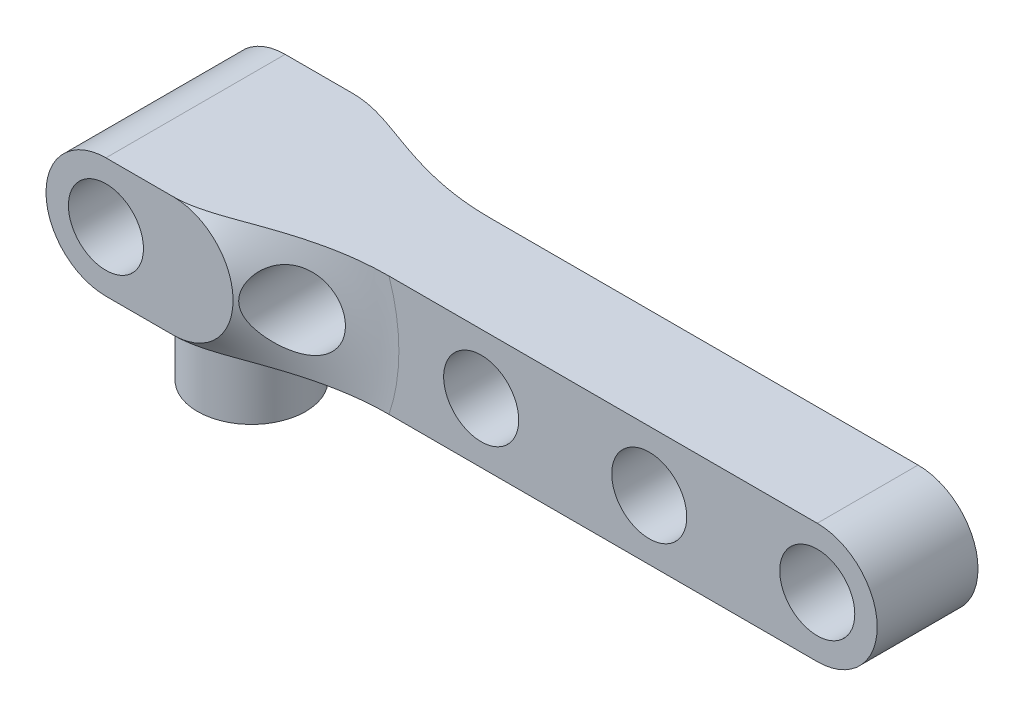
ISO-10303-21;
HEADER;
FILE_DESCRIPTION(('STEP AP214'),'2;1');
FILE_NAME('part.step','',(''),(''),'','','');
FILE_SCHEMA(('AUTOMOTIVE_DESIGN { 1 0 10303 214 1 1 1 1 }'));
ENDSEC;
DATA;
#1=APPLICATION_CONTEXT('core data for automotive mechanical design processes');
#2=APPLICATION_PROTOCOL_DEFINITION('international standard','automotive_design',2000,#1);
#3=PRODUCT_CONTEXT('',#1,'mechanical');
#4=PRODUCT('Part','Part','',(#3));
#5=PRODUCT_RELATED_PRODUCT_CATEGORY('part','',(#4));
#6=PRODUCT_DEFINITION_FORMATION('','',#4);
#7=PRODUCT_DEFINITION_CONTEXT('part definition',#1,'design');
#8=PRODUCT_DEFINITION('design','',#6,#7);
#9=PRODUCT_DEFINITION_SHAPE('','',#8);
#10=(LENGTH_UNIT() NAMED_UNIT(*) SI_UNIT(.MILLI.,.METRE.));
#11=(NAMED_UNIT(*) PLANE_ANGLE_UNIT() SI_UNIT($,.RADIAN.));
#12=(NAMED_UNIT(*) SI_UNIT($,.STERADIAN.) SOLID_ANGLE_UNIT());
#13=UNCERTAINTY_MEASURE_WITH_UNIT(LENGTH_MEASURE(1.E-05),#10,'distance_accuracy_value','');
#14=(GEOMETRIC_REPRESENTATION_CONTEXT(3) GLOBAL_UNCERTAINTY_ASSIGNED_CONTEXT((#13)) GLOBAL_UNIT_ASSIGNED_CONTEXT((#10,
#11,#12)) REPRESENTATION_CONTEXT('',''));
#15=CARTESIAN_POINT('',(0.,0.,0.));
#16=DIRECTION('',(0.,0.,1.));
#17=DIRECTION('',(1.,0.,0.));
#18=AXIS2_PLACEMENT_3D('',#15,#16,#17);
#19=CARTESIAN_POINT('',(-15.,0.,2.25));
#20=DIRECTION('',(0.,0.,1.));
#21=DIRECTION('',(1.,0.,0.));
#22=AXIS2_PLACEMENT_3D('',#19,#20,#21);
#23=PLANE('',#22);
#24=CARTESIAN_POINT('',(15.,0.,2.25));
#25=DIRECTION('',(0.,0.,1.));
#26=DIRECTION('',(1.,0.,0.));
#27=AXIS2_PLACEMENT_3D('',#24,#25,#26);
#28=CIRCLE('',#27,1.675);
#29=CARTESIAN_POINT('',(16.675,0.,2.25));
#30=VERTEX_POINT('',#29);
#31=EDGE_CURVE('E306',#30,#30,#28,.T.);
#32=ORIENTED_EDGE('',*,*,#31,.F.);
#33=EDGE_LOOP('',(#32));
#34=FACE_BOUND('',#33,.T.);
#35=CARTESIAN_POINT('',(0.,0.,2.25));
#36=DIRECTION('',(0.,0.,1.));
#37=DIRECTION('',(1.,0.,0.));
#38=AXIS2_PLACEMENT_3D('',#35,#36,#37);
#39=CIRCLE('',#38,1.675);
#40=CARTESIAN_POINT('',(1.675,0.,2.25));
#41=VERTEX_POINT('',#40);
#42=EDGE_CURVE('E226',#41,#41,#39,.T.);
#43=ORIENTED_EDGE('',*,*,#42,.F.);
#44=EDGE_LOOP('',(#43));
#45=FACE_BOUND('',#44,.T.);
#46=CARTESIAN_POINT('',(7.5,0.,2.25));
#47=DIRECTION('',(0.,0.,1.));
#48=DIRECTION('',(1.,0.,0.));
#49=AXIS2_PLACEMENT_3D('',#46,#47,#48);
#50=CIRCLE('',#49,1.675);
#51=CARTESIAN_POINT('',(9.175,0.,2.25));
#52=VERTEX_POINT('',#51);
#53=EDGE_CURVE('E237',#52,#52,#50,.T.);
#54=ORIENTED_EDGE('',*,*,#53,.F.);
#55=EDGE_LOOP('',(#54));
#56=FACE_BOUND('',#55,.T.);
#57=DIRECTION('',(-1.,0.,0.));
#58=VECTOR('',#57,1.);
#59=CARTESIAN_POINT('',(-15.,2.675,2.25));
#60=LINE('',#59,#58);
#61=CARTESIAN_POINT('',(15.,2.675,2.25));
#62=VERTEX_POINT('',#61);
#63=CARTESIAN_POINT('',(-4.1150712789621,2.675,2.25));
#64=VERTEX_POINT('',#63);
#65=EDGE_CURVE('E250',#62,#64,#60,.T.);
#66=ORIENTED_EDGE('',*,*,#65,.T.);
#67=CARTESIAN_POINT('',(-12.,0.,2.25));
#68=DIRECTION('',(0.,0.,1.));
#69=DIRECTION('',(1.,0.,0.));
#70=AXIS2_PLACEMENT_3D('',#67,#68,#69);
#71=CIRCLE('',#70,8.32632727772866);
#72=CARTESIAN_POINT('',(-4.1150712789621,-2.675,2.25));
#73=VERTEX_POINT('',#72);
#74=EDGE_CURVE('E127',#64,#73,#71,.F.);
#75=ORIENTED_EDGE('',*,*,#74,.T.);
#76=DIRECTION('',(1.,0.,0.));
#77=VECTOR('',#76,1.);
#78=CARTESIAN_POINT('',(-15.,-2.675,2.25));
#79=LINE('',#78,#77);
#80=CARTESIAN_POINT('',(15.,-2.675,2.25));
#81=VERTEX_POINT('',#80);
#82=EDGE_CURVE('E243',#73,#81,#79,.T.);
#83=ORIENTED_EDGE('',*,*,#82,.T.);
#84=CARTESIAN_POINT('',(15.,0.,2.25));
#85=DIRECTION('',(0.,0.,1.));
#86=DIRECTION('',(1.,0.,0.));
#87=AXIS2_PLACEMENT_3D('',#84,#85,#86);
#88=CIRCLE('',#87,2.675);
#89=EDGE_CURVE('E246',#81,#62,#88,.T.);
#90=ORIENTED_EDGE('',*,*,#89,.T.);
#91=EDGE_LOOP('',(#66,#75,#83,#90));
#92=FACE_BOUND('',#91,.T.);
#93=ADVANCED_FACE('F39',(#34,#45,#56,#92),#23,.T.);
#94=CARTESIAN_POINT('',(-15.,0.,-2.25));
#95=DIRECTION('',(0.,0.,1.));
#96=DIRECTION('',(1.,0.,0.));
#97=AXIS2_PLACEMENT_3D('',#94,#95,#96);
#98=PLANE('',#97);
#99=CARTESIAN_POINT('',(15.,0.,-2.25));
#100=DIRECTION('',(0.,0.,1.));
#101=DIRECTION('',(1.,0.,0.));
#102=AXIS2_PLACEMENT_3D('',#99,#100,#101);
#103=CIRCLE('',#102,1.675);
#104=CARTESIAN_POINT('',(16.675,0.,-2.25));
#105=VERTEX_POINT('',#104);
#106=EDGE_CURVE('E310',#105,#105,#103,.T.);
#107=ORIENTED_EDGE('',*,*,#106,.T.);
#108=EDGE_LOOP('',(#107));
#109=FACE_BOUND('',#108,.T.);
#110=CARTESIAN_POINT('',(7.5,0.,-2.25));
#111=DIRECTION('',(0.,0.,1.));
#112=DIRECTION('',(1.,0.,0.));
#113=AXIS2_PLACEMENT_3D('',#110,#111,#112);
#114=CIRCLE('',#113,1.675);
#115=CARTESIAN_POINT('',(9.175,0.,-2.25));
#116=VERTEX_POINT('',#115);
#117=EDGE_CURVE('E240',#116,#116,#114,.T.);
#118=ORIENTED_EDGE('',*,*,#117,.T.);
#119=EDGE_LOOP('',(#118));
#120=FACE_BOUND('',#119,.T.);
#121=CARTESIAN_POINT('',(0.,0.,-2.25));
#122=DIRECTION('',(0.,0.,1.));
#123=DIRECTION('',(1.,0.,0.));
#124=AXIS2_PLACEMENT_3D('',#121,#122,#123);
#125=CIRCLE('',#124,1.675);
#126=CARTESIAN_POINT('',(1.675,0.,-2.25));
#127=VERTEX_POINT('',#126);
#128=EDGE_CURVE('E231',#127,#127,#125,.T.);
#129=ORIENTED_EDGE('',*,*,#128,.T.);
#130=EDGE_LOOP('',(#129));
#131=FACE_BOUND('',#130,.T.);
#132=DIRECTION('',(1.,0.,0.));
#133=VECTOR('',#132,1.);
#134=CARTESIAN_POINT('',(-15.,-2.675,-2.25));
#135=LINE('',#134,#133);
#136=CARTESIAN_POINT('',(-4.1150712789621,-2.675,-2.25));
#137=VERTEX_POINT('',#136);
#138=CARTESIAN_POINT('',(15.,-2.675,-2.25));
#139=VERTEX_POINT('',#138);
#140=EDGE_CURVE('E219',#137,#139,#135,.T.);
#141=ORIENTED_EDGE('',*,*,#140,.F.);
#142=CARTESIAN_POINT('',(-12.,0.,-2.25));
#143=DIRECTION('',(0.,0.,1.));
#144=DIRECTION('',(1.,0.,0.));
#145=AXIS2_PLACEMENT_3D('',#142,#143,#144);
#146=CIRCLE('',#145,8.32632727772866);
#147=CARTESIAN_POINT('',(-4.1150712789621,2.675,-2.25));
#148=VERTEX_POINT('',#147);
#149=EDGE_CURVE('E270',#137,#148,#146,.T.);
#150=ORIENTED_EDGE('',*,*,#149,.T.);
#151=DIRECTION('',(-1.,0.,0.));
#152=VECTOR('',#151,1.);
#153=CARTESIAN_POINT('',(-15.,2.675,-2.25));
#154=LINE('',#153,#152);
#155=CARTESIAN_POINT('',(15.,2.675,-2.25));
#156=VERTEX_POINT('',#155);
#157=EDGE_CURVE('E247',#156,#148,#154,.T.);
#158=ORIENTED_EDGE('',*,*,#157,.F.);
#159=CARTESIAN_POINT('',(15.,0.,-2.25));
#160=DIRECTION('',(0.,0.,1.));
#161=DIRECTION('',(1.,0.,0.));
#162=AXIS2_PLACEMENT_3D('',#159,#160,#161);
#163=CIRCLE('',#162,2.675);
#164=EDGE_CURVE('E223',#139,#156,#163,.T.);
#165=ORIENTED_EDGE('',*,*,#164,.F.);
#166=EDGE_LOOP('',(#141,#150,#158,#165));
#167=FACE_BOUND('',#166,.T.);
#168=ADVANCED_FACE('F156',(#109,#120,#131,#167),#98,.F.);
#169=CARTESIAN_POINT('',(-15.,0.,2.25));
#170=DIRECTION('',(0.,0.,-1.));
#171=DIRECTION('',(-1.,0.,0.));
#172=AXIS2_PLACEMENT_3D('',#169,#170,#171);
#173=CYLINDRICAL_SURFACE('',#172,2.675);
#174=DIRECTION('',(0.,0.,-1.));
#175=VECTOR('',#174,1.);
#176=CARTESIAN_POINT('',(-15.,2.675,2.25));
#177=LINE('',#176,#175);
#178=CARTESIAN_POINT('',(-15.,2.675,4.));
#179=VERTEX_POINT('',#178);
#180=CARTESIAN_POINT('',(-15.,2.675,-4.));
#181=VERTEX_POINT('',#180);
#182=EDGE_CURVE('E110',#179,#181,#177,.T.);
#183=ORIENTED_EDGE('',*,*,#182,.T.);
#184=CARTESIAN_POINT('',(-15.,0.,-4.));
#185=DIRECTION('',(0.,0.,1.));
#186=DIRECTION('',(1.,0.,0.));
#187=AXIS2_PLACEMENT_3D('',#184,#185,#186);
#188=CIRCLE('',#187,2.675);
#189=CARTESIAN_POINT('',(-15.,-2.675,-4.));
#190=VERTEX_POINT('',#189);
#191=EDGE_CURVE('E294',#181,#190,#188,.T.);
#192=ORIENTED_EDGE('',*,*,#191,.T.);
#193=DIRECTION('',(0.,0.,-1.));
#194=VECTOR('',#193,1.);
#195=CARTESIAN_POINT('',(-15.,-2.675,2.25));
#196=LINE('',#195,#194);
#197=CARTESIAN_POINT('',(-15.,-2.675,4.));
#198=VERTEX_POINT('',#197);
#199=EDGE_CURVE('E267',#198,#190,#196,.T.);
#200=ORIENTED_EDGE('',*,*,#199,.F.);
#201=CARTESIAN_POINT('',(-15.,0.,4.));
#202=DIRECTION('',(0.,0.,1.));
#203=DIRECTION('',(1.,0.,0.));
#204=AXIS2_PLACEMENT_3D('',#201,#202,#203);
#205=CIRCLE('',#204,2.675);
#206=EDGE_CURVE('E115',#179,#198,#205,.T.);
#207=ORIENTED_EDGE('',*,*,#206,.F.);
#208=EDGE_LOOP('',(#183,#192,#200,#207));
#209=FACE_BOUND('',#208,.T.);
#210=ADVANCED_FACE('F176',(#209),#173,.T.);
#211=CARTESIAN_POINT('',(-15.,-2.675,2.25));
#212=DIRECTION('',(0.,1.,0.));
#213=DIRECTION('',(0.,0.,1.));
#214=AXIS2_PLACEMENT_3D('',#211,#212,#213);
#215=PLANE('',#214);
#216=CARTESIAN_POINT('',(-12.5,-2.675,0.));
#217=DIRECTION('',(0.,1.,0.));
#218=DIRECTION('',(0.,0.,1.));
#219=AXIS2_PLACEMENT_3D('',#216,#217,#218);
#220=CIRCLE('',#219,2.4146);
#221=CARTESIAN_POINT('',(-12.5,-2.675,2.4146));
#222=VERTEX_POINT('',#221);
#223=EDGE_CURVE('E11',#222,#222,#220,.F.);
#224=ORIENTED_EDGE('',*,*,#223,.F.);
#225=EDGE_LOOP('',(#224));
#226=FACE_BOUND('',#225,.T.);
#227=ORIENTED_EDGE('',*,*,#199,.T.);
#228=DIRECTION('',(1.,0.,0.));
#229=VECTOR('',#228,1.);
#230=CARTESIAN_POINT('',(-15.,-2.675,-4.));
#231=LINE('',#230,#229);
#232=CARTESIAN_POINT('',(-12.,-2.675,-4.));
#233=VERTEX_POINT('',#232);
#234=EDGE_CURVE('E124',#190,#233,#231,.T.);
#235=ORIENTED_EDGE('',*,*,#234,.T.);
#236=CARTESIAN_POINT('',(-12.,-2.675,-4.));
#237=CARTESIAN_POINT('',(-11.9406434531428,-2.675,-4.00001394925494));
#238=CARTESIAN_POINT('',(-11.8812914438209,-2.675,-3.99864701513769));
#239=CARTESIAN_POINT('',(-11.7627273467529,-2.675,-3.99325544617011));
#240=CARTESIAN_POINT('',(-11.7035152189759,-2.675,-3.98923169697365));
#241=CARTESIAN_POINT('',(-11.5856199549922,-2.675,-3.97865715756544));
#242=CARTESIAN_POINT('',(-11.5269356568403,-2.675,-3.97211920923495));
#243=CARTESIAN_POINT('',(-11.4098758642313,-2.675,-3.9567009178022));
#244=CARTESIAN_POINT('',(-11.3515003924756,-2.675,-3.94782040487585));
#245=CARTESIAN_POINT('',(-11.1769652204004,-2.675,-3.91800115324609));
#246=CARTESIAN_POINT('',(-11.0613418310201,-2.675,-3.89387939188613));
#247=CARTESIAN_POINT('',(-10.8890117792445,-2.675,-3.85282133412637));
#248=CARTESIAN_POINT('',(-10.8316985488899,-2.675,-3.83830659270522));
#249=CARTESIAN_POINT('',(-10.7174418021519,-2.675,-3.80790230821401));
#250=CARTESIAN_POINT('',(-10.6604982484454,-2.675,-3.79201290632709));
#251=CARTESIAN_POINT('',(-10.47056940762,-2.675,-3.73696192985336));
#252=CARTESIAN_POINT('',(-10.3383287889475,-2.675,-3.69524575065224));
#253=CARTESIAN_POINT('',(-10.075040273083,-2.675,-3.60818433291584));
#254=CARTESIAN_POINT('',(-9.94399271532131,-2.675,-3.56283809546612));
#255=CARTESIAN_POINT('',(-9.68236943639041,-2.675,-3.47047749612376));
#256=CARTESIAN_POINT('',(-9.55179419739272,-2.675,-3.42346178030654));
#257=CARTESIAN_POINT('',(-9.29070659445944,-2.675,-3.32930644579857));
#258=CARTESIAN_POINT('',(-9.1601942250026,-2.675,-3.28216684205029));
#259=CARTESIAN_POINT('',(-8.89901687197945,-2.675,-3.18896497672595));
#260=CARTESIAN_POINT('',(-8.76835246404011,-2.675,-3.142901116419));
#261=CARTESIAN_POINT('',(-8.50637508195865,-2.675,-3.05263618931163));
#262=CARTESIAN_POINT('',(-8.375062093825,-2.675,-3.00843516289506));
#263=CARTESIAN_POINT('',(-8.11165500282858,-2.675,-2.92258987508198));
#264=CARTESIAN_POINT('',(-7.97956123079111,-2.675,-2.8809446055403));
#265=CARTESIAN_POINT('',(-7.71444491048368,-2.675,-2.80072580963105));
#266=CARTESIAN_POINT('',(-7.58142235443362,-2.675,-2.76215230902823));
#267=CARTESIAN_POINT('',(-7.17947792082494,-2.675,-2.65132420221801));
#268=CARTESIAN_POINT('',(-6.90904330212611,-2.675,-2.58441691627093));
#269=CARTESIAN_POINT('',(-6.36453660798925,-2.675,-2.4674999355622));
#270=CARTESIAN_POINT('',(-6.09046470295773,-2.675,-2.41748945207112));
#271=CARTESIAN_POINT('',(-5.53380748865264,-2.675,-2.33533532525447));
#272=CARTESIAN_POINT('',(-5.25116321952226,-2.675,-2.30358175521111));
#273=CARTESIAN_POINT('',(-4.82592527140733,-2.675,-2.27157720653302));
#274=CARTESIAN_POINT('',(-4.68388692755053,-2.675,-2.26351319309605));
#275=CARTESIAN_POINT('',(-4.39959491903275,-2.675,-2.25272342355039));
#276=CARTESIAN_POINT('',(-4.25734123537064,-2.675,-2.24999816976263));
#277=CARTESIAN_POINT('',(-4.1150712789621,-2.675,-2.25));
#278=B_SPLINE_CURVE_WITH_KNOTS('',3,(#236,#237,#238,#239,#240,#241,#242,#243,#244,#245,#246,
#247,#248,#249,#250,#251,#252,#253,#254,#255,#256,#257,#258,#259,#260,#261,#262,#263,#264,#265,
#266,#267,#268,#269,#270,#271,#272,#273,#274,#275,#276,#277),.UNSPECIFIED.,.F.,.F.,(4,2,2,2,2,2,
2,2,2,2,2,2,2,2,2,2,2,2,2,2,4),(0.,0.178046532837259,0.356033743500868,0.533123663980979,
0.710226426113773,1.06426681243011,1.24162512920425,1.41896525214365,1.83484735232387,
2.25084429038093,2.66718666790429,3.08348094399999,3.49911109849096,3.91475025867891,
4.33022439760067,4.74570202098221,5.58096610718564,6.41619119853014,7.26865519978267,
7.69536861416892,8.12212217585539),.UNSPECIFIED.);
#279=EDGE_CURVE('E165',#233,#137,#278,.T.);
#280=ORIENTED_EDGE('',*,*,#279,.T.);
#281=ORIENTED_EDGE('',*,*,#140,.T.);
#282=DIRECTION('',(0.,0.,-1.));
#283=VECTOR('',#282,1.);
#284=CARTESIAN_POINT('',(15.,-2.675,2.25));
#285=LINE('',#284,#283);
#286=EDGE_CURVE('E263',#81,#139,#285,.T.);
#287=ORIENTED_EDGE('',*,*,#286,.F.);
#288=ORIENTED_EDGE('',*,*,#82,.F.);
#289=CARTESIAN_POINT('',(-4.1150712789621,-2.675,2.25));
#290=CARTESIAN_POINT('',(-4.28111925284089,-2.675,2.24999160694719));
#291=CARTESIAN_POINT('',(-4.44715837410671,-2.675,2.25370824345335));
#292=CARTESIAN_POINT('',(-4.77888970716395,-2.675,2.26838701893676));
#293=CARTESIAN_POINT('',(-4.94458197213002,-2.675,2.27934795100686));
#294=CARTESIAN_POINT('',(-5.27512503470194,-2.675,2.3082915537796));
#295=CARTESIAN_POINT('',(-5.43997666056649,-2.675,2.32626482737964));
#296=CARTESIAN_POINT('',(-5.76880584370179,-2.675,2.36896590923202));
#297=CARTESIAN_POINT('',(-5.93278336728483,-2.675,2.39369397592095));
#298=CARTESIAN_POINT('',(-6.25908709314421,-2.675,2.44948191750087));
#299=CARTESIAN_POINT('',(-6.4214169896761,-2.675,2.4805202731031));
#300=CARTESIAN_POINT('',(-6.74481938540478,-2.675,2.54857822871053));
#301=CARTESIAN_POINT('',(-6.90589183655771,-2.675,2.58559805609164));
#302=CARTESIAN_POINT('',(-7.22672723239802,-2.675,2.66513393291062));
#303=CARTESIAN_POINT('',(-7.38648970258988,-2.675,2.7076518877827));
#304=CARTESIAN_POINT('',(-7.70462808566502,-2.675,2.79754860923153));
#305=CARTESIAN_POINT('',(-7.86300404432641,-2.675,2.84492721466352));
#306=CARTESIAN_POINT('',(-8.18441483515863,-2.675,2.94561737960085));
#307=CARTESIAN_POINT('',(-8.34740041206318,-2.675,2.99908520673959));
#308=CARTESIAN_POINT('',(-8.6722404932261,-2.675,3.10924300641612));
#309=CARTESIAN_POINT('',(-8.83409516857741,-2.675,3.1659324791587));
#310=CARTESIAN_POINT('',(-9.15689820713599,-2.675,3.28088159266024));
#311=CARTESIAN_POINT('',(-9.31784770056398,-2.675,3.33913809061624));
#312=CARTESIAN_POINT('',(-9.64002323242337,-2.675,3.4552185746986));
#313=CARTESIAN_POINT('',(-9.80124938432422,-2.675,3.5130422411715));
#314=CARTESIAN_POINT('',(-10.1269763563987,-2.675,3.62589328293226));
#315=CARTESIAN_POINT('',(-10.2914929443297,-2.675,3.68087681648082));
#316=CARTESIAN_POINT('',(-10.5400033533732,-2.675,3.75721206712196));
#317=CARTESIAN_POINT('',(-10.6230499150291,-2.675,3.78161358899329));
#318=CARTESIAN_POINT('',(-10.7899137996848,-2.675,3.82767580763075));
#319=CARTESIAN_POINT('',(-10.8737311748374,-2.675,3.84933631745595));
#320=CARTESIAN_POINT('',(-11.0430194476382,-2.675,3.88933451803857));
#321=CARTESIAN_POINT('',(-11.1284984956527,-2.675,3.90763821003462));
#322=CARTESIAN_POINT('',(-11.3002665677526,-2.675,3.93983234190828));
#323=CARTESIAN_POINT('',(-11.3865553211732,-2.675,3.95372420599018));
#324=CARTESIAN_POINT('',(-11.5604495300035,-2.675,3.97643252173607));
#325=CARTESIAN_POINT('',(-11.6480599918411,-2.675,3.9852117537961));
#326=CARTESIAN_POINT('',(-11.7798126053922,-2.675,3.99405281389045));
#327=CARTESIAN_POINT('',(-11.8238167079159,-2.675,3.99627857439833));
#328=CARTESIAN_POINT('',(-11.9118793556773,-2.675,3.99925385849009));
#329=CARTESIAN_POINT('',(-11.9559379062375,-2.675,4.00000322406069));
#330=CARTESIAN_POINT('',(-12.,-2.675,4.));
#331=B_SPLINE_CURVE_WITH_KNOTS('',3,(#289,#290,#291,#292,#293,#294,#295,#296,#297,#298,#299,
#300,#301,#302,#303,#304,#305,#306,#307,#308,#309,#310,#311,#312,#313,#314,#315,#316,#317,#318,
#319,#320,#321,#322,#323,#324,#325,#326,#327,#328,#329,#330),.UNSPECIFIED.,.F.,.F.,(4,2,2,2,2,2,
2,2,2,2,2,2,2,2,2,2,2,2,2,2,4),(0.,0.4980891230619,0.996095284870479,1.49343635795578,
1.99079646184483,2.48648809614876,2.98219857779941,3.47808131589018,3.97394761932948,
4.48849422692056,5.00296122625456,5.51646376185869,6.03031408157246,6.55056973305723,
6.81020607269223,7.06986011036306,7.33201401137373,7.59408319894462,7.85803712268781,
7.99019618179236,8.12236938464084),.UNSPECIFIED.);
#332=CARTESIAN_POINT('',(-12.,-2.675,4.));
#333=VERTEX_POINT('',#332);
#334=EDGE_CURVE('E56',#73,#333,#331,.T.);
#335=ORIENTED_EDGE('',*,*,#334,.T.);
#336=DIRECTION('',(1.,0.,0.));
#337=VECTOR('',#336,1.);
#338=CARTESIAN_POINT('',(-15.,-2.675,4.));
#339=LINE('',#338,#337);
#340=EDGE_CURVE('E122',#198,#333,#339,.T.);
#341=ORIENTED_EDGE('',*,*,#340,.F.);
#342=EDGE_LOOP('',(#227,#235,#280,#281,#287,#288,#335,#341));
#343=FACE_BOUND('',#342,.T.);
#344=ADVANCED_FACE('F180',(#226,#343),#215,.F.);
#345=CARTESIAN_POINT('',(15.,0.,2.25));
#346=DIRECTION('',(0.,0.,-1.));
#347=DIRECTION('',(-1.,0.,0.));
#348=AXIS2_PLACEMENT_3D('',#345,#346,#347);
#349=CYLINDRICAL_SURFACE('',#348,2.675);
#350=ORIENTED_EDGE('',*,*,#164,.T.);
#351=DIRECTION('',(0.,0.,-1.));
#352=VECTOR('',#351,1.);
#353=CARTESIAN_POINT('',(15.,2.675,2.25));
#354=LINE('',#353,#352);
#355=EDGE_CURVE('E259',#62,#156,#354,.T.);
#356=ORIENTED_EDGE('',*,*,#355,.F.);
#357=ORIENTED_EDGE('',*,*,#89,.F.);
#358=ORIENTED_EDGE('',*,*,#286,.T.);
#359=EDGE_LOOP('',(#350,#356,#357,#358));
#360=FACE_BOUND('',#359,.T.);
#361=ADVANCED_FACE('F155',(#360),#349,.T.);
#362=CARTESIAN_POINT('',(-15.,2.675,2.25));
#363=DIRECTION('',(0.,-1.,0.));
#364=DIRECTION('',(0.,0.,-1.));
#365=AXIS2_PLACEMENT_3D('',#362,#363,#364);
#366=PLANE('',#365);
#367=ORIENTED_EDGE('',*,*,#157,.T.);
#368=CARTESIAN_POINT('',(-4.1150712789621,2.675,-2.25));
#369=CARTESIAN_POINT('',(-4.28111925284089,2.675,-2.24999160694719));
#370=CARTESIAN_POINT('',(-4.44715837410671,2.675,-2.25370824345335));
#371=CARTESIAN_POINT('',(-4.77888970716395,2.675,-2.26838701893676));
#372=CARTESIAN_POINT('',(-4.94458197213002,2.675,-2.27934795100686));
#373=CARTESIAN_POINT('',(-5.27512503470194,2.675,-2.3082915537796));
#374=CARTESIAN_POINT('',(-5.43997666056649,2.675,-2.32626482737964));
#375=CARTESIAN_POINT('',(-5.76880584370179,2.675,-2.36896590923202));
#376=CARTESIAN_POINT('',(-5.93278336728483,2.675,-2.39369397592095));
#377=CARTESIAN_POINT('',(-6.25908709314421,2.675,-2.44948191750087));
#378=CARTESIAN_POINT('',(-6.4214169896761,2.675,-2.4805202731031));
#379=CARTESIAN_POINT('',(-6.74481938540478,2.675,-2.54857822871053));
#380=CARTESIAN_POINT('',(-6.90589183655771,2.675,-2.58559805609164));
#381=CARTESIAN_POINT('',(-7.22672723239802,2.675,-2.66513393291062));
#382=CARTESIAN_POINT('',(-7.38648970258988,2.675,-2.7076518877827));
#383=CARTESIAN_POINT('',(-7.70462808566502,2.675,-2.79754860923153));
#384=CARTESIAN_POINT('',(-7.86300404432641,2.675,-2.84492721466352));
#385=CARTESIAN_POINT('',(-8.18441483515863,2.675,-2.94561737960085));
#386=CARTESIAN_POINT('',(-8.34740041206318,2.675,-2.99908520673959));
#387=CARTESIAN_POINT('',(-8.6722404932261,2.675,-3.10924300641612));
#388=CARTESIAN_POINT('',(-8.83409516857741,2.675,-3.1659324791587));
#389=CARTESIAN_POINT('',(-9.15689820713599,2.675,-3.28088159266024));
#390=CARTESIAN_POINT('',(-9.31784770056398,2.675,-3.33913809061624));
#391=CARTESIAN_POINT('',(-9.64002323242337,2.675,-3.4552185746986));
#392=CARTESIAN_POINT('',(-9.80124938432422,2.675,-3.5130422411715));
#393=CARTESIAN_POINT('',(-10.1269763563987,2.675,-3.62589328293226));
#394=CARTESIAN_POINT('',(-10.2914929443297,2.675,-3.68087681648082));
#395=CARTESIAN_POINT('',(-10.5400033533732,2.675,-3.75721206712196));
#396=CARTESIAN_POINT('',(-10.6230499150291,2.675,-3.78161358899329));
#397=CARTESIAN_POINT('',(-10.7899137996848,2.675,-3.82767580763075));
#398=CARTESIAN_POINT('',(-10.8737311748374,2.675,-3.84933631745595));
#399=CARTESIAN_POINT('',(-11.0430194476382,2.675,-3.88933451803857));
#400=CARTESIAN_POINT('',(-11.1284984956527,2.675,-3.90763821003462));
#401=CARTESIAN_POINT('',(-11.3002665677526,2.675,-3.93983234190828));
#402=CARTESIAN_POINT('',(-11.3865553211732,2.675,-3.95372420599018));
#403=CARTESIAN_POINT('',(-11.5604495300035,2.675,-3.97643252173607));
#404=CARTESIAN_POINT('',(-11.6480599918411,2.675,-3.9852117537961));
#405=CARTESIAN_POINT('',(-11.7798126053922,2.675,-3.99405281389045));
#406=CARTESIAN_POINT('',(-11.8238167079159,2.675,-3.99627857439833));
#407=CARTESIAN_POINT('',(-11.9118793556773,2.675,-3.99925385849009));
#408=CARTESIAN_POINT('',(-11.9559379062375,2.675,-4.00000322406069));
#409=CARTESIAN_POINT('',(-12.,2.675,-4.));
#410=B_SPLINE_CURVE_WITH_KNOTS('',3,(#368,#369,#370,#371,#372,#373,#374,#375,#376,#377,#378,
#379,#380,#381,#382,#383,#384,#385,#386,#387,#388,#389,#390,#391,#392,#393,#394,#395,#396,#397,
#398,#399,#400,#401,#402,#403,#404,#405,#406,#407,#408,#409),.UNSPECIFIED.,.F.,.F.,(4,2,2,2,2,2,
2,2,2,2,2,2,2,2,2,2,2,2,2,2,4),(0.,0.4980891230619,0.996095284870479,1.49343635795578,
1.99079646184483,2.48648809614876,2.98219857779941,3.47808131589018,3.97394761932948,
4.48849422692056,5.00296122625456,5.51646376185869,6.03031408157246,6.55056973305723,
6.81020607269223,7.06986011036306,7.33201401137373,7.59408319894462,7.85803712268781,
7.99019618179236,8.12236938464084),.UNSPECIFIED.);
#411=CARTESIAN_POINT('',(-12.,2.675,-4.));
#412=VERTEX_POINT('',#411);
#413=EDGE_CURVE('E131',#148,#412,#410,.T.);
#414=ORIENTED_EDGE('',*,*,#413,.T.);
#415=DIRECTION('',(-1.,0.,0.));
#416=VECTOR('',#415,1.);
#417=CARTESIAN_POINT('',(-12.,2.675,-4.));
#418=LINE('',#417,#416);
#419=EDGE_CURVE('E289',#412,#181,#418,.T.);
#420=ORIENTED_EDGE('',*,*,#419,.T.);
#421=ORIENTED_EDGE('',*,*,#182,.F.);
#422=DIRECTION('',(-1.,0.,0.));
#423=VECTOR('',#422,1.);
#424=CARTESIAN_POINT('',(-12.,2.675,4.));
#425=LINE('',#424,#423);
#426=CARTESIAN_POINT('',(-12.,2.675,4.));
#427=VERTEX_POINT('',#426);
#428=EDGE_CURVE('E105',#427,#179,#425,.T.);
#429=ORIENTED_EDGE('',*,*,#428,.F.);
#430=CARTESIAN_POINT('',(-12.,2.675,4.));
#431=CARTESIAN_POINT('',(-11.9406434531428,2.675,4.00001394925494));
#432=CARTESIAN_POINT('',(-11.8812914438209,2.675,3.99864701513769));
#433=CARTESIAN_POINT('',(-11.7627273467529,2.675,3.99325544617011));
#434=CARTESIAN_POINT('',(-11.7035152189759,2.675,3.98923169697365));
#435=CARTESIAN_POINT('',(-11.5856199549922,2.675,3.97865715756544));
#436=CARTESIAN_POINT('',(-11.5269356568403,2.675,3.97211920923495));
#437=CARTESIAN_POINT('',(-11.4098758642313,2.675,3.9567009178022));
#438=CARTESIAN_POINT('',(-11.3515003924756,2.675,3.94782040487585));
#439=CARTESIAN_POINT('',(-11.1769652204004,2.675,3.91800115324609));
#440=CARTESIAN_POINT('',(-11.0613418310201,2.675,3.89387939188613));
#441=CARTESIAN_POINT('',(-10.8890117792445,2.675,3.85282133412637));
#442=CARTESIAN_POINT('',(-10.8316985488899,2.675,3.83830659270522));
#443=CARTESIAN_POINT('',(-10.7174418021519,2.675,3.80790230821401));
#444=CARTESIAN_POINT('',(-10.6604982484454,2.675,3.79201290632709));
#445=CARTESIAN_POINT('',(-10.47056940762,2.675,3.73696192985336));
#446=CARTESIAN_POINT('',(-10.3383287889475,2.675,3.69524575065224));
#447=CARTESIAN_POINT('',(-10.075040273083,2.675,3.60818433291584));
#448=CARTESIAN_POINT('',(-9.94399271532131,2.675,3.56283809546612));
#449=CARTESIAN_POINT('',(-9.68236943639041,2.675,3.47047749612376));
#450=CARTESIAN_POINT('',(-9.55179419739272,2.675,3.42346178030654));
#451=CARTESIAN_POINT('',(-9.29070659445944,2.675,3.32930644579857));
#452=CARTESIAN_POINT('',(-9.1601942250026,2.675,3.28216684205029));
#453=CARTESIAN_POINT('',(-8.89901687197945,2.675,3.18896497672595));
#454=CARTESIAN_POINT('',(-8.76835246404011,2.675,3.142901116419));
#455=CARTESIAN_POINT('',(-8.50637508195865,2.675,3.05263618931163));
#456=CARTESIAN_POINT('',(-8.375062093825,2.675,3.00843516289506));
#457=CARTESIAN_POINT('',(-8.11165500282858,2.675,2.92258987508198));
#458=CARTESIAN_POINT('',(-7.97956123079111,2.675,2.8809446055403));
#459=CARTESIAN_POINT('',(-7.71444491048368,2.675,2.80072580963105));
#460=CARTESIAN_POINT('',(-7.58142235443362,2.675,2.76215230902823));
#461=CARTESIAN_POINT('',(-7.17947792082494,2.675,2.65132420221801));
#462=CARTESIAN_POINT('',(-6.90904330212611,2.675,2.58441691627093));
#463=CARTESIAN_POINT('',(-6.36453660798925,2.675,2.4674999355622));
#464=CARTESIAN_POINT('',(-6.09046470295773,2.675,2.41748945207112));
#465=CARTESIAN_POINT('',(-5.53380748865264,2.675,2.33533532525447));
#466=CARTESIAN_POINT('',(-5.25116321952226,2.675,2.30358175521111));
#467=CARTESIAN_POINT('',(-4.82592527140733,2.675,2.27157720653302));
#468=CARTESIAN_POINT('',(-4.68388692755053,2.675,2.26351319309605));
#469=CARTESIAN_POINT('',(-4.39959491903275,2.675,2.25272342355039));
#470=CARTESIAN_POINT('',(-4.25734123537064,2.675,2.24999816976263));
#471=CARTESIAN_POINT('',(-4.1150712789621,2.675,2.25));
#472=B_SPLINE_CURVE_WITH_KNOTS('',3,(#430,#431,#432,#433,#434,#435,#436,#437,#438,#439,#440,
#441,#442,#443,#444,#445,#446,#447,#448,#449,#450,#451,#452,#453,#454,#455,#456,#457,#458,#459,
#460,#461,#462,#463,#464,#465,#466,#467,#468,#469,#470,#471),.UNSPECIFIED.,.F.,.F.,(4,2,2,2,2,2,
2,2,2,2,2,2,2,2,2,2,2,2,2,2,4),(0.,0.178046532837259,0.356033743500868,0.533123663980979,
0.710226426113773,1.06426681243011,1.24162512920425,1.41896525214365,1.83484735232387,
2.25084429038093,2.66718666790429,3.08348094399999,3.49911109849096,3.91475025867891,
4.33022439760067,4.74570202098221,5.58096610718564,6.41619119853014,7.26865519978267,
7.69536861416892,8.12212217585539),.UNSPECIFIED.);
#473=EDGE_CURVE('E49',#427,#64,#472,.T.);
#474=ORIENTED_EDGE('',*,*,#473,.T.);
#475=ORIENTED_EDGE('',*,*,#65,.F.);
#476=ORIENTED_EDGE('',*,*,#355,.T.);
#477=EDGE_LOOP('',(#367,#414,#420,#421,#429,#474,#475,#476));
#478=FACE_BOUND('',#477,.T.);
#479=ADVANCED_FACE('F108',(#478),#366,.F.);
#480=CARTESIAN_POINT('',(-7.5,0.,2.25));
#481=DIRECTION('',(0.,0.,-1.));
#482=DIRECTION('',(-1.,0.,0.));
#483=AXIS2_PLACEMENT_3D('',#480,#481,#482);
#484=CYLINDRICAL_SURFACE('',#483,1.675);
#485=CARTESIAN_POINT('',(-9.175,0.,3.89922768940988));
#486=CARTESIAN_POINT('',(-9.17500196303199,-0.0764248745655639,3.89923093620755));
#487=CARTESIAN_POINT('',(-9.1697236924737,-0.152840654167315,3.89364842217995));
#488=CARTESIAN_POINT('',(-9.14913199606773,-0.302897185877064,3.87237136243271));
#489=CARTESIAN_POINT('',(-9.13380177280721,-0.376533074410415,3.85665989136058));
#490=CARTESIAN_POINT('',(-9.09446233644724,-0.518347475419137,3.81771727327998));
#491=CARTESIAN_POINT('',(-9.07054639096581,-0.586575366478835,3.79456720581964));
#492=CARTESIAN_POINT('',(-9.01510705302307,-0.717741634032839,3.7431005860857));
#493=CARTESIAN_POINT('',(-8.98357888845246,-0.780676658920614,3.71478079563384));
#494=CARTESIAN_POINT('',(-8.8968661854452,-0.930073928917585,3.64050464149197));
#495=CARTESIAN_POINT('',(-8.8376079581378,-1.01323332543126,3.59263245400811));
#496=CARTESIAN_POINT('',(-8.70600531162792,-1.16679684672621,3.49441866648899));
#497=CARTESIAN_POINT('',(-8.63364418151828,-1.23718445068815,3.44407397357641));
#498=CARTESIAN_POINT('',(-8.47664586723417,-1.36457963782845,3.34344523424842));
#499=CARTESIAN_POINT('',(-8.39191223861988,-1.42147192425342,3.29316512216161));
#500=CARTESIAN_POINT('',(-8.21241227986211,-1.5193855790919,3.19519270523864));
#501=CARTESIAN_POINT('',(-8.11765170303885,-1.56041598660197,3.14749893990208));
#502=CARTESIAN_POINT('',(-7.91931427633301,-1.62505143820977,3.05560388568529));
#503=CARTESIAN_POINT('',(-7.81565091772739,-1.64845712092373,3.01144745927185));
#504=CARTESIAN_POINT('',(-7.60374729398805,-1.67518623489098,2.92824716828246));
#505=CARTESIAN_POINT('',(-7.49550850153759,-1.67851607908201,2.8892016749918));
#506=CARTESIAN_POINT('',(-7.28739594965202,-1.66445363242267,2.819728941846));
#507=CARTESIAN_POINT('',(-7.1875572253197,-1.64872335855186,2.78885919348605));
#508=CARTESIAN_POINT('',(-6.99107022018779,-1.59902157263877,2.73203948249968));
#509=CARTESIAN_POINT('',(-6.89442055614719,-1.56505808257682,2.70608736307626));
#510=CARTESIAN_POINT('',(-6.71419736911832,-1.48233441684374,2.6605605838883));
#511=CARTESIAN_POINT('',(-6.63018174260489,-1.43470435763133,2.64067720595881));
#512=CARTESIAN_POINT('',(-6.47104467531007,-1.32521572937765,2.60488402238206));
#513=CARTESIAN_POINT('',(-6.39592134509999,-1.26336019120562,2.5889733718126));
#514=CARTESIAN_POINT('',(-6.25956318621142,-1.12949540883161,2.56131597396118));
#515=CARTESIAN_POINT('',(-6.19794166856075,-1.05790506277121,2.54944558222376));
#516=CARTESIAN_POINT('',(-6.08743799537658,-0.90508664160946,2.52886076611877));
#517=CARTESIAN_POINT('',(-6.03855474421614,-0.823859396259519,2.52014607030251));
#518=CARTESIAN_POINT('',(-5.95568690759922,-0.65530199600697,2.50572310209358));
#519=CARTESIAN_POINT('',(-5.92150466810768,-0.568072369980236,2.49997472268839));
#520=CARTESIAN_POINT('',(-5.86812416387536,-0.389015381283854,2.4911179891309));
#521=CARTESIAN_POINT('',(-5.84892544375001,-0.29718815843631,2.48800955474418));
#522=CARTESIAN_POINT('',(-5.82615941040463,-0.112005510555294,2.48433304624596));
#523=CARTESIAN_POINT('',(-5.82251921375063,-0.0186592717698587,2.48375312712305));
#524=CARTESIAN_POINT('',(-5.83078112078872,0.167324497070238,2.4850805139317));
#525=CARTESIAN_POINT('',(-5.84268304887812,0.25996203512026,2.48698779176166));
#526=CARTESIAN_POINT('',(-5.88164623341667,0.441808124510704,2.49335377094335));
#527=CARTESIAN_POINT('',(-5.90869307645915,0.531019850062362,2.49781004650209));
#528=CARTESIAN_POINT('',(-5.97710481012813,0.703583404760723,2.50942004841073));
#529=CARTESIAN_POINT('',(-6.01846959966759,0.78693527527396,2.51657375571635));
#530=CARTESIAN_POINT('',(-6.11430666001719,0.94555658314546,2.53380400476248));
#531=CARTESIAN_POINT('',(-6.16879763138409,1.02081426562718,2.54388472078841));
#532=CARTESIAN_POINT('',(-6.28915006099283,1.16103588168084,2.5672188510945));
#533=CARTESIAN_POINT('',(-6.35501151034981,1.22599982329621,2.58047226289552));
#534=CARTESIAN_POINT('',(-6.49643857462085,1.34425960511071,2.61049826203051));
#535=CARTESIAN_POINT('',(-6.57205727972201,1.39748694246688,2.62729044656944));
#536=CARTESIAN_POINT('',(-6.73030605610338,1.49051059156248,2.66457740612171));
#537=CARTESIAN_POINT('',(-6.8129363292516,1.53030651643772,2.68507228775753));
#538=CARTESIAN_POINT('',(-6.98396671743143,1.59620267348118,2.73026640982085));
#539=CARTESIAN_POINT('',(-7.07243674496402,1.62207951254603,2.75502626387078));
#540=CARTESIAN_POINT('',(-7.25123542973096,1.65893872483214,2.80854810706437));
#541=CARTESIAN_POINT('',(-7.34156431899118,1.66991922708195,2.83731059843689));
#542=CARTESIAN_POINT('',(-7.52461875897422,1.67740848631308,2.89976864819425));
#543=CARTESIAN_POINT('',(-7.61731832336849,1.67340033558781,2.93360104346453));
#544=CARTESIAN_POINT('',(-7.79936369430504,1.65058463735409,3.00502748315398));
#545=CARTESIAN_POINT('',(-7.88870886185081,1.63177428493392,3.04262223933512));
#546=CARTESIAN_POINT('',(-8.06728322077192,1.57892820560204,3.12338996552051));
#547=CARTESIAN_POINT('',(-8.15616313003694,1.54402237044584,3.16676415926407));
#548=CARTESIAN_POINT('',(-8.32580101245829,1.46035481913069,3.25602084410626));
#549=CARTESIAN_POINT('',(-8.40655350683646,1.41158383992139,3.30190499545583));
#550=CARTESIAN_POINT('',(-8.56462005996676,1.29711224025862,3.39847914815687));
#551=CARTESIAN_POINT('',(-8.64111647618436,1.2303552453227,3.44925588600595));
#552=CARTESIAN_POINT('',(-8.7813316932466,1.08356888166333,3.54936348686432));
#553=CARTESIAN_POINT('',(-8.84505149608359,1.00354055463007,3.59869446299666));
#554=CARTESIAN_POINT('',(-8.9456721093378,0.849798931866002,3.6816521002044));
#555=CARTESIAN_POINT('',(-8.98539125395833,0.778511816581879,3.71635797970122));
#556=CARTESIAN_POINT('',(-9.05476500849925,0.628595124057431,3.77949278493144));
#557=CARTESIAN_POINT('',(-9.08443254039715,0.549975140866785,3.80792975317756));
#558=CARTESIAN_POINT('',(-9.12985565688738,0.393908282475306,3.85265299613356));
#559=CARTESIAN_POINT('',(-9.1466454212299,0.317027442662157,3.86982085100158));
#560=CARTESIAN_POINT('',(-9.16920433671925,0.160089440754466,3.8930942238136));
#561=CARTESIAN_POINT('',(-9.17499794411759,0.0800397325343135,3.89922428904032));
#562=CARTESIAN_POINT('',(-9.175,0.,3.89922768940988));
#563=B_SPLINE_CURVE_WITH_KNOTS('',3,(#485,#486,#487,#488,#489,#490,#491,#492,#493,#494,#495,
#496,#497,#498,#499,#500,#501,#502,#503,#504,#505,#506,#507,#508,#509,#510,#511,#512,#513,#514,
#515,#516,#517,#518,#519,#520,#521,#522,#523,#524,#525,#526,#527,#528,#529,#530,#531,#532,#533,
#534,#535,#536,#537,#538,#539,#540,#541,#542,#543,#544,#545,#546,#547,#548,#549,#550,#551,#552,
#553,#554,#555,#556,#557,#558,#559,#560,#561,#562),.UNSPECIFIED.,.T.,.F.,(4,2,2,2,2,2,2,2,2,2,2,
2,2,2,2,2,2,2,2,2,2,2,2,2,2,2,2,2,2,2,2,2,2,2,2,2,2,2,4),(0.,0.228911734200148,
0.458206971800311,0.685083196016341,0.912102020202417,1.24867612785076,1.58568255104919,
1.92547207733588,2.26506768373268,2.60844918081903,2.95172098381337,3.26709641307178,
3.58233320169902,3.87667300521543,4.17095015493002,4.45517749929018,4.73938038898825,
5.01963270498059,5.29987650311105,5.57880605880633,5.85773246304357,6.13639386325337,
6.41505329610842,6.69411210109798,6.97317068803233,7.25381729975953,7.53447199424531,
7.81950594587803,8.10457569429998,8.39956574168566,8.69461170104739,9.00791486276546,
9.32142783049824,9.66051158437232,9.99956873555312,10.264716279901,10.5295216555121,
10.7697958153833,11.0095349589999),.UNSPECIFIED.);
#564=CARTESIAN_POINT('',(-9.175,0.,3.89922768940988));
#565=VERTEX_POINT('',#564);
#566=EDGE_CURVE('E213',#565,#565,#563,.T.);
#567=ORIENTED_EDGE('',*,*,#566,.T.);
#568=EDGE_LOOP('',(#567));
#569=FACE_BOUND('',#568,.T.);
#570=CARTESIAN_POINT('',(-9.175,0.,-3.89922768940988));
#571=CARTESIAN_POINT('',(-9.17500196303199,-0.0764248745655639,-3.89923093620755));
#572=CARTESIAN_POINT('',(-9.1697236924737,-0.152840654167315,-3.89364842217995));
#573=CARTESIAN_POINT('',(-9.14913199606773,-0.302897185877064,-3.87237136243271));
#574=CARTESIAN_POINT('',(-9.13380177280721,-0.376533074410415,-3.85665989136058));
#575=CARTESIAN_POINT('',(-9.09446233644724,-0.518347475419137,-3.81771727327998));
#576=CARTESIAN_POINT('',(-9.07054639096581,-0.586575366478835,-3.79456720581964));
#577=CARTESIAN_POINT('',(-9.01510705302307,-0.717741634032839,-3.7431005860857));
#578=CARTESIAN_POINT('',(-8.98357888845246,-0.780676658920614,-3.71478079563384));
#579=CARTESIAN_POINT('',(-8.8968661854452,-0.930073928917585,-3.64050464149197));
#580=CARTESIAN_POINT('',(-8.8376079581378,-1.01323332543126,-3.59263245400811));
#581=CARTESIAN_POINT('',(-8.70600531162792,-1.16679684672621,-3.49441866648899));
#582=CARTESIAN_POINT('',(-8.63364418151828,-1.23718445068815,-3.44407397357641));
#583=CARTESIAN_POINT('',(-8.47664586723417,-1.36457963782845,-3.34344523424842));
#584=CARTESIAN_POINT('',(-8.39191223861988,-1.42147192425342,-3.29316512216161));
#585=CARTESIAN_POINT('',(-8.21241227986211,-1.5193855790919,-3.19519270523864));
#586=CARTESIAN_POINT('',(-8.11765170303885,-1.56041598660197,-3.14749893990208));
#587=CARTESIAN_POINT('',(-7.91931427633301,-1.62505143820977,-3.05560388568529));
#588=CARTESIAN_POINT('',(-7.81565091772739,-1.64845712092373,-3.01144745927185));
#589=CARTESIAN_POINT('',(-7.60374729398805,-1.67518623489098,-2.92824716828246));
#590=CARTESIAN_POINT('',(-7.49550850153759,-1.67851607908201,-2.8892016749918));
#591=CARTESIAN_POINT('',(-7.28739594965202,-1.66445363242267,-2.819728941846));
#592=CARTESIAN_POINT('',(-7.1875572253197,-1.64872335855186,-2.78885919348605));
#593=CARTESIAN_POINT('',(-6.99107022018779,-1.59902157263877,-2.73203948249968));
#594=CARTESIAN_POINT('',(-6.89442055614719,-1.56505808257682,-2.70608736307626));
#595=CARTESIAN_POINT('',(-6.71419736911832,-1.48233441684374,-2.6605605838883));
#596=CARTESIAN_POINT('',(-6.63018174260489,-1.43470435763133,-2.64067720595881));
#597=CARTESIAN_POINT('',(-6.47104467531007,-1.32521572937765,-2.60488402238206));
#598=CARTESIAN_POINT('',(-6.39592134509999,-1.26336019120562,-2.5889733718126));
#599=CARTESIAN_POINT('',(-6.25956318621142,-1.12949540883161,-2.56131597396118));
#600=CARTESIAN_POINT('',(-6.19794166856075,-1.05790506277121,-2.54944558222376));
#601=CARTESIAN_POINT('',(-6.08743799537658,-0.90508664160946,-2.52886076611877));
#602=CARTESIAN_POINT('',(-6.03855474421614,-0.823859396259519,-2.52014607030251));
#603=CARTESIAN_POINT('',(-5.95568690759922,-0.65530199600697,-2.50572310209358));
#604=CARTESIAN_POINT('',(-5.92150466810768,-0.568072369980236,-2.49997472268839));
#605=CARTESIAN_POINT('',(-5.86812416387536,-0.389015381283854,-2.4911179891309));
#606=CARTESIAN_POINT('',(-5.84892544375001,-0.29718815843631,-2.48800955474418));
#607=CARTESIAN_POINT('',(-5.82615941040463,-0.112005510555294,-2.48433304624596));
#608=CARTESIAN_POINT('',(-5.82251921375063,-0.0186592717698587,-2.48375312712305));
#609=CARTESIAN_POINT('',(-5.83078112078872,0.167324497070238,-2.4850805139317));
#610=CARTESIAN_POINT('',(-5.84268304887812,0.25996203512026,-2.48698779176166));
#611=CARTESIAN_POINT('',(-5.88164623341667,0.441808124510704,-2.49335377094335));
#612=CARTESIAN_POINT('',(-5.90869307645915,0.531019850062362,-2.49781004650209));
#613=CARTESIAN_POINT('',(-5.97710481012813,0.703583404760723,-2.50942004841073));
#614=CARTESIAN_POINT('',(-6.01846959966759,0.78693527527396,-2.51657375571635));
#615=CARTESIAN_POINT('',(-6.11430666001719,0.94555658314546,-2.53380400476248));
#616=CARTESIAN_POINT('',(-6.16879763138409,1.02081426562718,-2.54388472078841));
#617=CARTESIAN_POINT('',(-6.28915006099283,1.16103588168084,-2.5672188510945));
#618=CARTESIAN_POINT('',(-6.35501151034981,1.22599982329621,-2.58047226289552));
#619=CARTESIAN_POINT('',(-6.49643857462085,1.34425960511071,-2.61049826203051));
#620=CARTESIAN_POINT('',(-6.57205727972201,1.39748694246688,-2.62729044656944));
#621=CARTESIAN_POINT('',(-6.73030605610338,1.49051059156248,-2.66457740612171));
#622=CARTESIAN_POINT('',(-6.8129363292516,1.53030651643772,-2.68507228775753));
#623=CARTESIAN_POINT('',(-6.98396671743143,1.59620267348118,-2.73026640982085));
#624=CARTESIAN_POINT('',(-7.07243674496402,1.62207951254603,-2.75502626387078));
#625=CARTESIAN_POINT('',(-7.25123542973096,1.65893872483214,-2.80854810706437));
#626=CARTESIAN_POINT('',(-7.34156431899118,1.66991922708195,-2.83731059843689));
#627=CARTESIAN_POINT('',(-7.52461875897422,1.67740848631308,-2.89976864819425));
#628=CARTESIAN_POINT('',(-7.61731832336849,1.67340033558781,-2.93360104346453));
#629=CARTESIAN_POINT('',(-7.79936369430504,1.65058463735409,-3.00502748315398));
#630=CARTESIAN_POINT('',(-7.88870886185081,1.63177428493392,-3.04262223933512));
#631=CARTESIAN_POINT('',(-8.06728322077192,1.57892820560204,-3.12338996552051));
#632=CARTESIAN_POINT('',(-8.15616313003694,1.54402237044584,-3.16676415926407));
#633=CARTESIAN_POINT('',(-8.32580101245829,1.46035481913069,-3.25602084410626));
#634=CARTESIAN_POINT('',(-8.40655350683646,1.41158383992139,-3.30190499545583));
#635=CARTESIAN_POINT('',(-8.56462005996676,1.29711224025862,-3.39847914815687));
#636=CARTESIAN_POINT('',(-8.64111647618436,1.2303552453227,-3.44925588600595));
#637=CARTESIAN_POINT('',(-8.7813316932466,1.08356888166333,-3.54936348686432));
#638=CARTESIAN_POINT('',(-8.84505149608359,1.00354055463007,-3.59869446299666));
#639=CARTESIAN_POINT('',(-8.9456721093378,0.849798931866002,-3.6816521002044));
#640=CARTESIAN_POINT('',(-8.98539125395833,0.778511816581879,-3.71635797970122));
#641=CARTESIAN_POINT('',(-9.05476500849925,0.628595124057431,-3.77949278493144));
#642=CARTESIAN_POINT('',(-9.08443254039715,0.549975140866785,-3.80792975317756));
#643=CARTESIAN_POINT('',(-9.12985565688738,0.393908282475306,-3.85265299613356));
#644=CARTESIAN_POINT('',(-9.1466454212299,0.317027442662157,-3.86982085100158));
#645=CARTESIAN_POINT('',(-9.16920433671925,0.160089440754466,-3.8930942238136));
#646=CARTESIAN_POINT('',(-9.17499794411759,0.0800397325343135,-3.89922428904032));
#647=CARTESIAN_POINT('',(-9.175,0.,-3.89922768940988));
#648=B_SPLINE_CURVE_WITH_KNOTS('',3,(#570,#571,#572,#573,#574,#575,#576,#577,#578,#579,#580,
#581,#582,#583,#584,#585,#586,#587,#588,#589,#590,#591,#592,#593,#594,#595,#596,#597,#598,#599,
#600,#601,#602,#603,#604,#605,#606,#607,#608,#609,#610,#611,#612,#613,#614,#615,#616,#617,#618,
#619,#620,#621,#622,#623,#624,#625,#626,#627,#628,#629,#630,#631,#632,#633,#634,#635,#636,#637,
#638,#639,#640,#641,#642,#643,#644,#645,#646,#647),.UNSPECIFIED.,.T.,.F.,(4,2,2,2,2,2,2,2,2,2,2,
2,2,2,2,2,2,2,2,2,2,2,2,2,2,2,2,2,2,2,2,2,2,2,2,2,2,2,4),(0.,0.228911734200148,
0.458206971800311,0.685083196016341,0.912102020202417,1.24867612785076,1.58568255104919,
1.92547207733588,2.26506768373268,2.60844918081903,2.95172098381337,3.26709641307178,
3.58233320169902,3.87667300521543,4.17095015493002,4.45517749929018,4.73938038898825,
5.01963270498059,5.29987650311105,5.57880605880633,5.85773246304357,6.13639386325337,
6.41505329610842,6.69411210109798,6.97317068803233,7.25381729975953,7.53447199424531,
7.81950594587803,8.10457569429998,8.39956574168566,8.69461170104739,9.00791486276546,
9.32142783049824,9.66051158437232,9.99956873555312,10.264716279901,10.5295216555121,
10.7697958153833,11.0095349589999),.UNSPECIFIED.);
#649=CARTESIAN_POINT('',(-9.175,0.,-3.89922768940988));
#650=VERTEX_POINT('',#649);
#651=EDGE_CURVE('E145',#650,#650,#648,.T.);
#652=ORIENTED_EDGE('',*,*,#651,.F.);
#653=EDGE_LOOP('',(#652));
#654=FACE_BOUND('',#653,.T.);
#655=ADVANCED_FACE('F154',(#569,#654),#484,.F.);
#656=CARTESIAN_POINT('',(0.,0.,2.25));
#657=DIRECTION('',(0.,0.,-1.));
#658=DIRECTION('',(-1.,0.,0.));
#659=AXIS2_PLACEMENT_3D('',#656,#657,#658);
#660=CYLINDRICAL_SURFACE('',#659,1.675);
#661=ORIENTED_EDGE('',*,*,#42,.T.);
#662=EDGE_LOOP('',(#661));
#663=FACE_BOUND('',#662,.T.);
#664=ORIENTED_EDGE('',*,*,#128,.F.);
#665=EDGE_LOOP('',(#664));
#666=FACE_BOUND('',#665,.T.);
#667=ADVANCED_FACE('F209',(#663,#666),#660,.F.);
#668=CARTESIAN_POINT('',(7.5,0.,2.25));
#669=DIRECTION('',(0.,0.,-1.));
#670=DIRECTION('',(-1.,0.,0.));
#671=AXIS2_PLACEMENT_3D('',#668,#669,#670);
#672=CYLINDRICAL_SURFACE('',#671,1.675);
#673=ORIENTED_EDGE('',*,*,#53,.T.);
#674=EDGE_LOOP('',(#673));
#675=FACE_BOUND('',#674,.T.);
#676=ORIENTED_EDGE('',*,*,#117,.F.);
#677=EDGE_LOOP('',(#676));
#678=FACE_BOUND('',#677,.T.);
#679=ADVANCED_FACE('F323',(#675,#678),#672,.F.);
#680=CARTESIAN_POINT('',(15.,0.,2.25));
#681=DIRECTION('',(0.,0.,-1.));
#682=DIRECTION('',(-1.,0.,0.));
#683=AXIS2_PLACEMENT_3D('',#680,#681,#682);
#684=CYLINDRICAL_SURFACE('',#683,1.675);
#685=ORIENTED_EDGE('',*,*,#31,.T.);
#686=EDGE_LOOP('',(#685));
#687=FACE_BOUND('',#686,.T.);
#688=ORIENTED_EDGE('',*,*,#106,.F.);
#689=EDGE_LOOP('',(#688));
#690=FACE_BOUND('',#689,.T.);
#691=ADVANCED_FACE('F325',(#687,#690),#684,.F.);
#692=CARTESIAN_POINT('',(-12.,0.,-4.));
#693=DIRECTION('',(0.,0.,-1.));
#694=DIRECTION('',(-1.,0.,0.));
#695=AXIS2_PLACEMENT_3D('',#692,#693,#694);
#696=PLANE('',#695);
#697=CARTESIAN_POINT('',(-12.,0.,-4.));
#698=DIRECTION('',(0.,0.,1.));
#699=DIRECTION('',(-1.,0.,0.));
#700=AXIS2_PLACEMENT_3D('',#697,#698,#699);
#701=CIRCLE('',#700,2.675);
#702=EDGE_CURVE('E287',#233,#412,#701,.T.);
#703=ORIENTED_EDGE('',*,*,#702,.F.);
#704=ORIENTED_EDGE('',*,*,#234,.F.);
#705=ORIENTED_EDGE('',*,*,#191,.F.);
#706=ORIENTED_EDGE('',*,*,#419,.F.);
#707=EDGE_LOOP('',(#703,#704,#705,#706));
#708=FACE_BOUND('',#707,.T.);
#709=CARTESIAN_POINT('',(-15.,0.,-4.));
#710=DIRECTION('',(0.,0.,1.));
#711=DIRECTION('',(1.,0.,0.));
#712=AXIS2_PLACEMENT_3D('',#709,#710,#711);
#713=CIRCLE('',#712,1.675);
#714=CARTESIAN_POINT('',(-13.325,0.,-4.));
#715=VERTEX_POINT('',#714);
#716=EDGE_CURVE('E350',#715,#715,#713,.T.);
#717=ORIENTED_EDGE('',*,*,#716,.T.);
#718=EDGE_LOOP('',(#717));
#719=FACE_BOUND('',#718,.T.);
#720=ADVANCED_FACE('F204',(#708,#719),#696,.T.);
#721=CARTESIAN_POINT('',(-15.,0.,2.25));
#722=DIRECTION('',(0.,0.,-1.));
#723=DIRECTION('',(-1.,0.,0.));
#724=AXIS2_PLACEMENT_3D('',#721,#722,#723);
#725=CYLINDRICAL_SURFACE('',#724,1.675);
#726=ORIENTED_EDGE('',*,*,#716,.F.);
#727=EDGE_LOOP('',(#726));
#728=FACE_BOUND('',#727,.T.);
#729=CARTESIAN_POINT('',(-15.,0.,4.));
#730=DIRECTION('',(0.,0.,1.));
#731=DIRECTION('',(1.,0.,0.));
#732=AXIS2_PLACEMENT_3D('',#729,#730,#731);
#733=CIRCLE('',#732,1.675);
#734=CARTESIAN_POINT('',(-13.325,0.,4.));
#735=VERTEX_POINT('',#734);
#736=EDGE_CURVE('E300',#735,#735,#733,.T.);
#737=ORIENTED_EDGE('',*,*,#736,.T.);
#738=EDGE_LOOP('',(#737));
#739=FACE_BOUND('',#738,.T.);
#740=ADVANCED_FACE('F202',(#728,#739),#725,.F.);
#741=CARTESIAN_POINT('',(-12.,0.,4.));
#742=DIRECTION('',(0.,0.,-1.));
#743=DIRECTION('',(-1.,0.,0.));
#744=AXIS2_PLACEMENT_3D('',#741,#742,#743);
#745=PLANE('',#744);
#746=CARTESIAN_POINT('',(-12.,0.,4.));
#747=DIRECTION('',(0.,0.,1.));
#748=DIRECTION('',(-1.,0.,0.));
#749=AXIS2_PLACEMENT_3D('',#746,#747,#748);
#750=CIRCLE('',#749,2.675);
#751=EDGE_CURVE('E116',#333,#427,#750,.T.);
#752=ORIENTED_EDGE('',*,*,#751,.T.);
#753=ORIENTED_EDGE('',*,*,#428,.T.);
#754=ORIENTED_EDGE('',*,*,#206,.T.);
#755=ORIENTED_EDGE('',*,*,#340,.T.);
#756=EDGE_LOOP('',(#752,#753,#754,#755));
#757=FACE_BOUND('',#756,.T.);
#758=ORIENTED_EDGE('',*,*,#736,.F.);
#759=EDGE_LOOP('',(#758));
#760=FACE_BOUND('',#759,.T.);
#761=ADVANCED_FACE('F119',(#757,#760),#745,.F.);
#762=CARTESIAN_POINT('',(-12.,0.,-12.25));
#763=DIRECTION('',(0.,0.,1.));
#764=DIRECTION('',(1.,0.,0.));
#765=AXIS2_PLACEMENT_3D('',#762,#763,#764);
#766=DEGENERATE_TOROIDAL_SURFACE('',#765,8.32632727772866,10.,.T.);
#767=ORIENTED_EDGE('',*,*,#413,.F.);
#768=ORIENTED_EDGE('',*,*,#149,.F.);
#769=ORIENTED_EDGE('',*,*,#279,.F.);
#770=ORIENTED_EDGE('',*,*,#702,.T.);
#771=EDGE_LOOP('',(#767,#768,#769,#770));
#772=FACE_BOUND('',#771,.T.);
#773=ORIENTED_EDGE('',*,*,#651,.T.);
#774=EDGE_LOOP('',(#773));
#775=FACE_BOUND('',#774,.T.);
#776=ADVANCED_FACE('F171',(#772,#775),#766,.F.);
#777=CARTESIAN_POINT('',(-12.,0.,12.25));
#778=DIRECTION('',(0.,0.,1.));
#779=DIRECTION('',(1.,0.,0.));
#780=AXIS2_PLACEMENT_3D('',#777,#778,#779);
#781=DEGENERATE_TOROIDAL_SURFACE('',#780,8.32632727772866,10.,.T.);
#782=ORIENTED_EDGE('',*,*,#473,.F.);
#783=ORIENTED_EDGE('',*,*,#751,.F.);
#784=ORIENTED_EDGE('',*,*,#334,.F.);
#785=ORIENTED_EDGE('',*,*,#74,.F.);
#786=EDGE_LOOP('',(#782,#783,#784,#785));
#787=FACE_BOUND('',#786,.T.);
#788=ORIENTED_EDGE('',*,*,#566,.F.);
#789=EDGE_LOOP('',(#788));
#790=FACE_BOUND('',#789,.T.);
#791=ADVANCED_FACE('F41',(#787,#790),#781,.F.);
#792=CARTESIAN_POINT('',(-12.5,-6.675,0.));
#793=DIRECTION('',(0.,1.,0.));
#794=DIRECTION('',(0.,0.,1.));
#795=AXIS2_PLACEMENT_3D('',#792,#793,#794);
#796=CYLINDRICAL_SURFACE('',#795,2.4146);
#797=CARTESIAN_POINT('',(-12.5,-6.675,0.));
#798=DIRECTION('',(0.,-1.,0.));
#799=DIRECTION('',(0.,0.,-1.));
#800=AXIS2_PLACEMENT_3D('',#797,#798,#799);
#801=CIRCLE('',#800,2.4146);
#802=CARTESIAN_POINT('',(-12.5,-6.675,-2.4146));
#803=VERTEX_POINT('',#802);
#804=EDGE_CURVE('E348',#803,#803,#801,.T.);
#805=ORIENTED_EDGE('',*,*,#804,.F.);
#806=EDGE_LOOP('',(#805));
#807=FACE_BOUND('',#806,.T.);
#808=ORIENTED_EDGE('',*,*,#223,.T.);
#809=EDGE_LOOP('',(#808));
#810=FACE_BOUND('',#809,.T.);
#811=ADVANCED_FACE('F337',(#807,#810),#796,.T.);
#812=CARTESIAN_POINT('',(-12.5,-6.675,0.));
#813=DIRECTION('',(0.,-1.,0.));
#814=DIRECTION('',(0.,0.,-1.));
#815=AXIS2_PLACEMENT_3D('',#812,#813,#814);
#816=PLANE('',#815);
#817=ORIENTED_EDGE('',*,*,#804,.T.);
#818=EDGE_LOOP('',(#817));
#819=FACE_BOUND('',#818,.T.);
#820=ADVANCED_FACE('F340',(#819),#816,.T.);
#821=CLOSED_SHELL('',(#93,#168,#210,#344,#361,#479,#655,#667,#679,#691,#720,#740,#761,#776,#791,
#811,#820));
#822=MANIFOLD_SOLID_BREP('B2',#821);
#823=ADVANCED_BREP_SHAPE_REPRESENTATION('',(#18,#822),#14);
#824=SHAPE_DEFINITION_REPRESENTATION(#9,#823);
ENDSEC;
END-ISO-10303-21;
